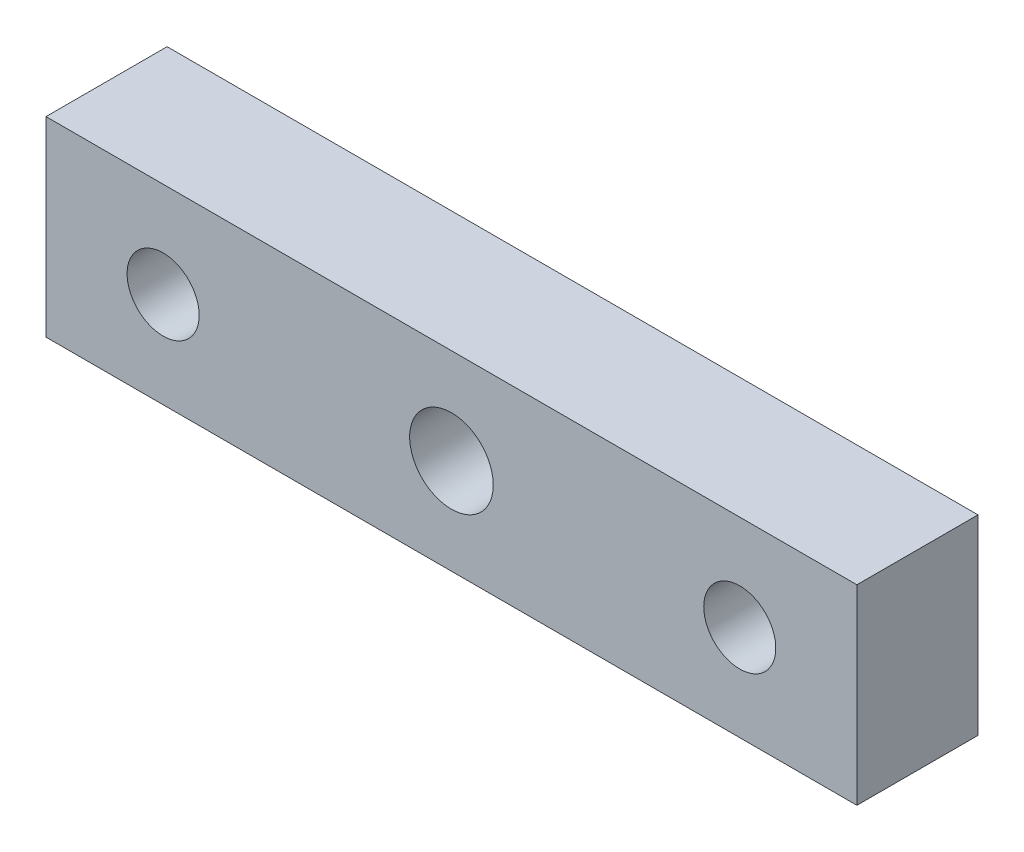
ISO-10303-21;
HEADER;
FILE_DESCRIPTION(('STEP AP214'),'2;1');
FILE_NAME('part.step','',(''),(''),'','','');
FILE_SCHEMA(('AUTOMOTIVE_DESIGN { 1 0 10303 214 1 1 1 1 }'));
ENDSEC;
DATA;
#1=APPLICATION_CONTEXT('core data for automotive mechanical design processes');
#2=APPLICATION_PROTOCOL_DEFINITION('international standard','automotive_design',2000,#1);
#3=PRODUCT_CONTEXT('',#1,'mechanical');
#4=PRODUCT('Part','Part','',(#3));
#5=PRODUCT_RELATED_PRODUCT_CATEGORY('part','',(#4));
#6=PRODUCT_DEFINITION_FORMATION('','',#4);
#7=PRODUCT_DEFINITION_CONTEXT('part definition',#1,'design');
#8=PRODUCT_DEFINITION('design','',#6,#7);
#9=PRODUCT_DEFINITION_SHAPE('','',#8);
#10=(LENGTH_UNIT() NAMED_UNIT(*) SI_UNIT(.MILLI.,.METRE.));
#11=(NAMED_UNIT(*) PLANE_ANGLE_UNIT() SI_UNIT($,.RADIAN.));
#12=(NAMED_UNIT(*) SI_UNIT($,.STERADIAN.) SOLID_ANGLE_UNIT());
#13=UNCERTAINTY_MEASURE_WITH_UNIT(LENGTH_MEASURE(1.E-05),#10,'distance_accuracy_value','');
#14=(GEOMETRIC_REPRESENTATION_CONTEXT(3) GLOBAL_UNCERTAINTY_ASSIGNED_CONTEXT((#13)) GLOBAL_UNIT_ASSIGNED_CONTEXT((#10,
#11,#12)) REPRESENTATION_CONTEXT('',''));
#15=CARTESIAN_POINT('',(0.,0.,0.));
#16=DIRECTION('',(0.,0.,1.));
#17=DIRECTION('',(1.,0.,0.));
#18=AXIS2_PLACEMENT_3D('',#15,#16,#17);
#19=CARTESIAN_POINT('',(28.125,6.625,8.4));
#20=DIRECTION('',(0.,0.,-1.));
#21=DIRECTION('',(-1.,0.,0.));
#22=AXIS2_PLACEMENT_3D('',#19,#20,#21);
#23=PLANE('',#22);
#24=CARTESIAN_POINT('',(-20.,0.,8.4));
#25=DIRECTION('',(0.,0.,1.));
#26=DIRECTION('',(1.,0.,0.));
#27=AXIS2_PLACEMENT_3D('',#24,#25,#26);
#28=CIRCLE('',#27,2.5);
#29=CARTESIAN_POINT('',(-17.5,0.,8.4));
#30=VERTEX_POINT('',#29);
#31=EDGE_CURVE('E115',#30,#30,#28,.T.);
#32=ORIENTED_EDGE('',*,*,#31,.F.);
#33=EDGE_LOOP('',(#32));
#34=FACE_BOUND('',#33,.T.);
#35=DIRECTION('',(0.,1.,0.));
#36=VECTOR('',#35,1.);
#37=CARTESIAN_POINT('',(28.125,-6.625,8.4));
#38=LINE('',#37,#36);
#39=CARTESIAN_POINT('',(28.125,-6.625,8.4));
#40=VERTEX_POINT('',#39);
#41=CARTESIAN_POINT('',(28.125,6.625,8.4));
#42=VERTEX_POINT('',#41);
#43=EDGE_CURVE('E85',#40,#42,#38,.T.);
#44=ORIENTED_EDGE('',*,*,#43,.T.);
#45=DIRECTION('',(-1.,0.,0.));
#46=VECTOR('',#45,1.);
#47=CARTESIAN_POINT('',(-28.125,6.625,8.4));
#48=LINE('',#47,#46);
#49=CARTESIAN_POINT('',(-28.125,6.625,8.4));
#50=VERTEX_POINT('',#49);
#51=EDGE_CURVE('E80',#42,#50,#48,.T.);
#52=ORIENTED_EDGE('',*,*,#51,.T.);
#53=DIRECTION('',(0.,-1.,0.));
#54=VECTOR('',#53,1.);
#55=CARTESIAN_POINT('',(-28.125,-6.625,8.4));
#56=LINE('',#55,#54);
#57=CARTESIAN_POINT('',(-28.125,-6.625,8.4));
#58=VERTEX_POINT('',#57);
#59=EDGE_CURVE('E83',#50,#58,#56,.T.);
#60=ORIENTED_EDGE('',*,*,#59,.T.);
#61=DIRECTION('',(1.,0.,0.));
#62=VECTOR('',#61,1.);
#63=CARTESIAN_POINT('',(-28.125,-6.625,8.4));
#64=LINE('',#63,#62);
#65=EDGE_CURVE('E50',#58,#40,#64,.T.);
#66=ORIENTED_EDGE('',*,*,#65,.T.);
#67=EDGE_LOOP('',(#44,#52,#60,#66));
#68=FACE_BOUND('',#67,.T.);
#69=CARTESIAN_POINT('',(0.,0.,8.4));
#70=DIRECTION('',(0.,0.,1.));
#71=DIRECTION('',(1.,0.,0.));
#72=AXIS2_PLACEMENT_3D('',#69,#70,#71);
#73=CIRCLE('',#72,2.9);
#74=CARTESIAN_POINT('',(2.89999999999999,0.,8.4));
#75=VERTEX_POINT('',#74);
#76=EDGE_CURVE('E100',#75,#75,#73,.T.);
#77=ORIENTED_EDGE('',*,*,#76,.F.);
#78=EDGE_LOOP('',(#77));
#79=FACE_BOUND('',#78,.T.);
#80=CARTESIAN_POINT('',(20.,0.,8.4));
#81=DIRECTION('',(0.,0.,1.));
#82=DIRECTION('',(-1.,0.,0.));
#83=AXIS2_PLACEMENT_3D('',#80,#81,#82);
#84=CIRCLE('',#83,2.5);
#85=CARTESIAN_POINT('',(17.5,0.,8.4));
#86=VERTEX_POINT('',#85);
#87=EDGE_CURVE('E121',#86,#86,#84,.T.);
#88=ORIENTED_EDGE('',*,*,#87,.F.);
#89=EDGE_LOOP('',(#88));
#90=FACE_BOUND('',#89,.T.);
#91=ADVANCED_FACE('F33',(#34,#68,#79,#90),#23,.F.);
#92=CARTESIAN_POINT('',(28.125,6.625,0.));
#93=DIRECTION('',(0.,0.,-1.));
#94=DIRECTION('',(-1.,0.,0.));
#95=AXIS2_PLACEMENT_3D('',#92,#93,#94);
#96=PLANE('',#95);
#97=CARTESIAN_POINT('',(-20.,0.,0.));
#98=DIRECTION('',(0.,0.,1.));
#99=DIRECTION('',(1.,0.,0.));
#100=AXIS2_PLACEMENT_3D('',#97,#98,#99);
#101=CIRCLE('',#100,2.5);
#102=CARTESIAN_POINT('',(-17.5,0.,0.));
#103=VERTEX_POINT('',#102);
#104=EDGE_CURVE('E118',#103,#103,#101,.T.);
#105=ORIENTED_EDGE('',*,*,#104,.T.);
#106=EDGE_LOOP('',(#105));
#107=FACE_BOUND('',#106,.T.);
#108=DIRECTION('',(0.,1.,0.));
#109=VECTOR('',#108,1.);
#110=CARTESIAN_POINT('',(28.125,-6.625,0.));
#111=LINE('',#110,#109);
#112=CARTESIAN_POINT('',(28.125,-6.625,0.));
#113=VERTEX_POINT('',#112);
#114=CARTESIAN_POINT('',(28.125,6.625,0.));
#115=VERTEX_POINT('',#114);
#116=EDGE_CURVE('E97',#113,#115,#111,.T.);
#117=ORIENTED_EDGE('',*,*,#116,.F.);
#118=DIRECTION('',(1.,0.,0.));
#119=VECTOR('',#118,1.);
#120=CARTESIAN_POINT('',(-28.125,-6.625,0.));
#121=LINE('',#120,#119);
#122=CARTESIAN_POINT('',(-28.125,-6.625,0.));
#123=VERTEX_POINT('',#122);
#124=EDGE_CURVE('E73',#123,#113,#121,.T.);
#125=ORIENTED_EDGE('',*,*,#124,.F.);
#126=DIRECTION('',(0.,-1.,0.));
#127=VECTOR('',#126,1.);
#128=CARTESIAN_POINT('',(-28.125,-6.625,0.));
#129=LINE('',#128,#127);
#130=CARTESIAN_POINT('',(-28.125,6.625,0.));
#131=VERTEX_POINT('',#130);
#132=EDGE_CURVE('E67',#131,#123,#129,.T.);
#133=ORIENTED_EDGE('',*,*,#132,.F.);
#134=DIRECTION('',(-1.,0.,0.));
#135=VECTOR('',#134,1.);
#136=CARTESIAN_POINT('',(-28.125,6.625,0.));
#137=LINE('',#136,#135);
#138=EDGE_CURVE('E89',#115,#131,#137,.T.);
#139=ORIENTED_EDGE('',*,*,#138,.F.);
#140=EDGE_LOOP('',(#117,#125,#133,#139));
#141=FACE_BOUND('',#140,.T.);
#142=CARTESIAN_POINT('',(0.,0.,0.));
#143=DIRECTION('',(0.,0.,1.));
#144=DIRECTION('',(1.,0.,0.));
#145=AXIS2_PLACEMENT_3D('',#142,#143,#144);
#146=CIRCLE('',#145,2.9);
#147=CARTESIAN_POINT('',(2.89999999999999,0.,0.));
#148=VERTEX_POINT('',#147);
#149=EDGE_CURVE('E112',#148,#148,#146,.T.);
#150=ORIENTED_EDGE('',*,*,#149,.T.);
#151=EDGE_LOOP('',(#150));
#152=FACE_BOUND('',#151,.T.);
#153=CARTESIAN_POINT('',(20.,0.,0.));
#154=DIRECTION('',(0.,0.,1.));
#155=DIRECTION('',(-1.,0.,0.));
#156=AXIS2_PLACEMENT_3D('',#153,#154,#155);
#157=CIRCLE('',#156,2.5);
#158=CARTESIAN_POINT('',(17.5,0.,0.));
#159=VERTEX_POINT('',#158);
#160=EDGE_CURVE('E124',#159,#159,#157,.T.);
#161=ORIENTED_EDGE('',*,*,#160,.T.);
#162=EDGE_LOOP('',(#161));
#163=FACE_BOUND('',#162,.T.);
#164=ADVANCED_FACE('F108',(#107,#141,#152,#163),#96,.T.);
#165=CARTESIAN_POINT('',(28.125,-6.625,8.4));
#166=DIRECTION('',(-1.,0.,0.));
#167=DIRECTION('',(0.,0.,1.));
#168=AXIS2_PLACEMENT_3D('',#165,#166,#167);
#169=PLANE('',#168);
#170=ORIENTED_EDGE('',*,*,#116,.T.);
#171=DIRECTION('',(0.,0.,-1.));
#172=VECTOR('',#171,1.);
#173=CARTESIAN_POINT('',(28.125,6.625,8.4));
#174=LINE('',#173,#172);
#175=EDGE_CURVE('E11',#42,#115,#174,.T.);
#176=ORIENTED_EDGE('',*,*,#175,.F.);
#177=ORIENTED_EDGE('',*,*,#43,.F.);
#178=DIRECTION('',(0.,0.,-1.));
#179=VECTOR('',#178,1.);
#180=CARTESIAN_POINT('',(28.125,-6.625,8.4));
#181=LINE('',#180,#179);
#182=EDGE_CURVE('E93',#40,#113,#181,.T.);
#183=ORIENTED_EDGE('',*,*,#182,.T.);
#184=EDGE_LOOP('',(#170,#176,#177,#183));
#185=FACE_BOUND('',#184,.T.);
#186=ADVANCED_FACE('F35',(#185),#169,.F.);
#187=CARTESIAN_POINT('',(-28.125,6.625,8.4));
#188=DIRECTION('',(0.,-1.,0.));
#189=DIRECTION('',(0.,0.,-1.));
#190=AXIS2_PLACEMENT_3D('',#187,#188,#189);
#191=PLANE('',#190);
#192=ORIENTED_EDGE('',*,*,#138,.T.);
#193=DIRECTION('',(0.,0.,-1.));
#194=VECTOR('',#193,1.);
#195=CARTESIAN_POINT('',(-28.125,6.625,8.4));
#196=LINE('',#195,#194);
#197=EDGE_CURVE('E42',#50,#131,#196,.T.);
#198=ORIENTED_EDGE('',*,*,#197,.F.);
#199=ORIENTED_EDGE('',*,*,#51,.F.);
#200=ORIENTED_EDGE('',*,*,#175,.T.);
#201=EDGE_LOOP('',(#192,#198,#199,#200));
#202=FACE_BOUND('',#201,.T.);
#203=ADVANCED_FACE('F88',(#202),#191,.F.);
#204=CARTESIAN_POINT('',(-28.125,-6.625,8.4));
#205=DIRECTION('',(1.,0.,0.));
#206=DIRECTION('',(0.,0.,-1.));
#207=AXIS2_PLACEMENT_3D('',#204,#205,#206);
#208=PLANE('',#207);
#209=ORIENTED_EDGE('',*,*,#132,.T.);
#210=DIRECTION('',(0.,0.,-1.));
#211=VECTOR('',#210,1.);
#212=CARTESIAN_POINT('',(-28.125,-6.625,8.4));
#213=LINE('',#212,#211);
#214=EDGE_CURVE('E90',#58,#123,#213,.T.);
#215=ORIENTED_EDGE('',*,*,#214,.F.);
#216=ORIENTED_EDGE('',*,*,#59,.F.);
#217=ORIENTED_EDGE('',*,*,#197,.T.);
#218=EDGE_LOOP('',(#209,#215,#216,#217));
#219=FACE_BOUND('',#218,.T.);
#220=ADVANCED_FACE('F91',(#219),#208,.F.);
#221=CARTESIAN_POINT('',(-28.125,-6.625,8.4));
#222=DIRECTION('',(0.,1.,0.));
#223=DIRECTION('',(0.,0.,1.));
#224=AXIS2_PLACEMENT_3D('',#221,#222,#223);
#225=PLANE('',#224);
#226=ORIENTED_EDGE('',*,*,#124,.T.);
#227=ORIENTED_EDGE('',*,*,#182,.F.);
#228=ORIENTED_EDGE('',*,*,#65,.F.);
#229=ORIENTED_EDGE('',*,*,#214,.T.);
#230=EDGE_LOOP('',(#226,#227,#228,#229));
#231=FACE_BOUND('',#230,.T.);
#232=ADVANCED_FACE('F105',(#231),#225,.F.);
#233=CARTESIAN_POINT('',(0.,0.,8.4));
#234=DIRECTION('',(0.,0.,-1.));
#235=DIRECTION('',(-1.,0.,0.));
#236=AXIS2_PLACEMENT_3D('',#233,#234,#235);
#237=CYLINDRICAL_SURFACE('',#236,2.9);
#238=ORIENTED_EDGE('',*,*,#76,.T.);
#239=EDGE_LOOP('',(#238));
#240=FACE_BOUND('',#239,.T.);
#241=ORIENTED_EDGE('',*,*,#149,.F.);
#242=EDGE_LOOP('',(#241));
#243=FACE_BOUND('',#242,.T.);
#244=ADVANCED_FACE('F143',(#240,#243),#237,.F.);
#245=CARTESIAN_POINT('',(-20.,0.,8.4));
#246=DIRECTION('',(0.,0.,-1.));
#247=DIRECTION('',(-1.,0.,0.));
#248=AXIS2_PLACEMENT_3D('',#245,#246,#247);
#249=CYLINDRICAL_SURFACE('',#248,2.5);
#250=ORIENTED_EDGE('',*,*,#31,.T.);
#251=EDGE_LOOP('',(#250));
#252=FACE_BOUND('',#251,.T.);
#253=ORIENTED_EDGE('',*,*,#104,.F.);
#254=EDGE_LOOP('',(#253));
#255=FACE_BOUND('',#254,.T.);
#256=ADVANCED_FACE('F189',(#252,#255),#249,.F.);
#257=CARTESIAN_POINT('',(20.,0.,8.4));
#258=DIRECTION('',(0.,0.,-1.));
#259=DIRECTION('',(-1.,0.,0.));
#260=AXIS2_PLACEMENT_3D('',#257,#258,#259);
#261=CYLINDRICAL_SURFACE('',#260,2.5);
#262=ORIENTED_EDGE('',*,*,#87,.T.);
#263=EDGE_LOOP('',(#262));
#264=FACE_BOUND('',#263,.T.);
#265=ORIENTED_EDGE('',*,*,#160,.F.);
#266=EDGE_LOOP('',(#265));
#267=FACE_BOUND('',#266,.T.);
#268=ADVANCED_FACE('F130',(#264,#267),#261,.F.);
#269=CLOSED_SHELL('',(#91,#164,#186,#203,#220,#232,#244,#256,#268));
#270=MANIFOLD_SOLID_BREP('B2',#269);
#271=ADVANCED_BREP_SHAPE_REPRESENTATION('',(#18,#270),#14);
#272=SHAPE_DEFINITION_REPRESENTATION(#9,#271);
ENDSEC;
END-ISO-10303-21;
